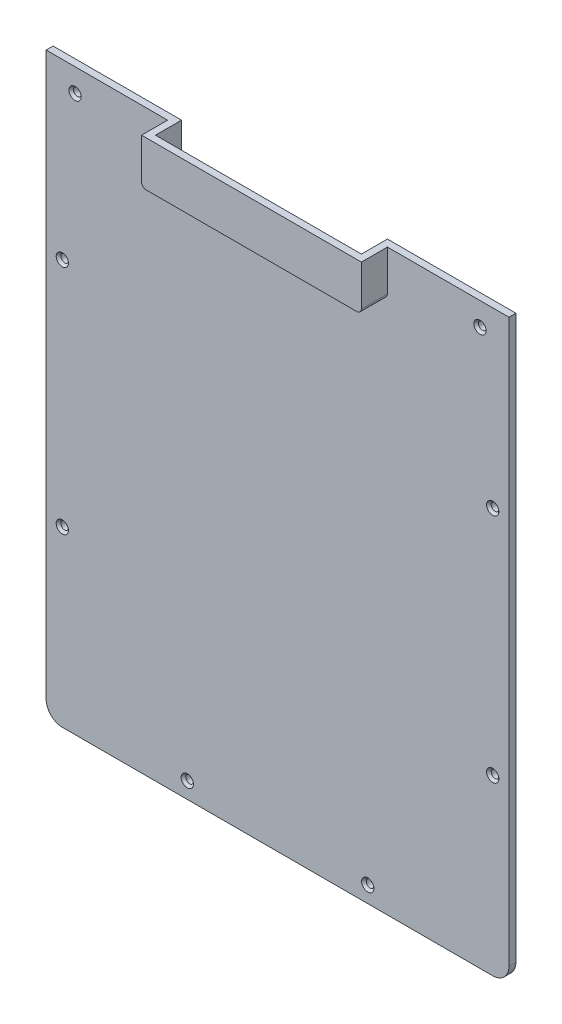
ISO-10303-21;
HEADER;
FILE_DESCRIPTION(('STEP AP214'),'2;1');
FILE_NAME('part.step','',(''),(''),'','','');
FILE_SCHEMA(('AUTOMOTIVE_DESIGN { 1 0 10303 214 1 1 1 1 }'));
ENDSEC;
DATA;
#1=APPLICATION_CONTEXT('core data for automotive mechanical design processes');
#2=APPLICATION_PROTOCOL_DEFINITION('international standard','automotive_design',2000,#1);
#3=PRODUCT_CONTEXT('',#1,'mechanical');
#4=PRODUCT('Part','Part','',(#3));
#5=PRODUCT_RELATED_PRODUCT_CATEGORY('part','',(#4));
#6=PRODUCT_DEFINITION_FORMATION('','',#4);
#7=PRODUCT_DEFINITION_CONTEXT('part definition',#1,'design');
#8=PRODUCT_DEFINITION('design','',#6,#7);
#9=PRODUCT_DEFINITION_SHAPE('','',#8);
#10=(LENGTH_UNIT() NAMED_UNIT(*) SI_UNIT(.MILLI.,.METRE.));
#11=(NAMED_UNIT(*) PLANE_ANGLE_UNIT() SI_UNIT($,.RADIAN.));
#12=(NAMED_UNIT(*) SI_UNIT($,.STERADIAN.) SOLID_ANGLE_UNIT());
#13=UNCERTAINTY_MEASURE_WITH_UNIT(LENGTH_MEASURE(1.E-05),#10,'distance_accuracy_value','');
#14=(GEOMETRIC_REPRESENTATION_CONTEXT(3) GLOBAL_UNCERTAINTY_ASSIGNED_CONTEXT((#13)) GLOBAL_UNIT_ASSIGNED_CONTEXT((#10,
#11,#12)) REPRESENTATION_CONTEXT('',''));
#15=CARTESIAN_POINT('',(0.,0.,0.));
#16=DIRECTION('',(0.,0.,1.));
#17=DIRECTION('',(1.,0.,0.));
#18=AXIS2_PLACEMENT_3D('',#15,#16,#17);
#19=CARTESIAN_POINT('',(0.,250.,3.));
#20=DIRECTION('',(0.,-1.,0.));
#21=DIRECTION('',(0.,0.,-1.));
#22=AXIS2_PLACEMENT_3D('',#19,#20,#21);
#23=PLANE('',#22);
#24=DIRECTION('',(0.,0.,-1.));
#25=VECTOR('',#24,1.);
#26=CARTESIAN_POINT('',(55.5,250.,93.5165730681404));
#27=LINE('',#26,#25);
#28=CARTESIAN_POINT('',(55.5,250.,11.2500000000001));
#29=VERTEX_POINT('',#28);
#30=CARTESIAN_POINT('',(55.5,250.,0.));
#31=VERTEX_POINT('',#30);
#32=EDGE_CURVE('E215',#29,#31,#27,.T.);
#33=ORIENTED_EDGE('',*,*,#32,.T.);
#34=DIRECTION('',(-1.,0.,0.));
#35=VECTOR('',#34,1.);
#36=CARTESIAN_POINT('',(0.,250.,0.));
#37=LINE('',#36,#35);
#38=CARTESIAN_POINT('',(0.,250.,0.));
#39=VERTEX_POINT('',#38);
#40=EDGE_CURVE('E241',#31,#39,#37,.T.);
#41=ORIENTED_EDGE('',*,*,#40,.T.);
#42=DIRECTION('',(0.,0.,-1.));
#43=VECTOR('',#42,1.);
#44=CARTESIAN_POINT('',(0.,250.,3.));
#45=LINE('',#44,#43);
#46=CARTESIAN_POINT('',(0.,250.,3.));
#47=VERTEX_POINT('',#46);
#48=EDGE_CURVE('E233',#47,#39,#45,.T.);
#49=ORIENTED_EDGE('',*,*,#48,.F.);
#50=DIRECTION('',(-1.,0.,0.));
#51=VECTOR('',#50,1.);
#52=CARTESIAN_POINT('',(0.,250.,3.));
#53=LINE('',#52,#51);
#54=CARTESIAN_POINT('',(52.5,250.,3.));
#55=VERTEX_POINT('',#54);
#56=EDGE_CURVE('E230',#55,#47,#53,.T.);
#57=ORIENTED_EDGE('',*,*,#56,.F.);
#58=DIRECTION('',(0.,0.,-1.));
#59=VECTOR('',#58,1.);
#60=CARTESIAN_POINT('',(52.5,250.,11.2500000000001));
#61=LINE('',#60,#59);
#62=CARTESIAN_POINT('',(52.5,250.,14.2500000000001));
#63=VERTEX_POINT('',#62);
#64=EDGE_CURVE('E180',#63,#55,#61,.T.);
#65=ORIENTED_EDGE('',*,*,#64,.F.);
#66=DIRECTION('',(-1.,0.,0.));
#67=VECTOR('',#66,1.);
#68=CARTESIAN_POINT('',(52.5,250.,14.2500000000001));
#69=LINE('',#68,#67);
#70=CARTESIAN_POINT('',(147.5,250.,14.2500000000001));
#71=VERTEX_POINT('',#70);
#72=EDGE_CURVE('E164',#71,#63,#69,.T.);
#73=ORIENTED_EDGE('',*,*,#72,.F.);
#74=DIRECTION('',(0.,0.,-1.));
#75=VECTOR('',#74,1.);
#76=CARTESIAN_POINT('',(147.5,250.,11.2500000000001));
#77=LINE('',#76,#75);
#78=CARTESIAN_POINT('',(147.5,250.,3.));
#79=VERTEX_POINT('',#78);
#80=EDGE_CURVE('E173',#71,#79,#77,.T.);
#81=ORIENTED_EDGE('',*,*,#80,.T.);
#82=CARTESIAN_POINT('',(200.,250.,3.));
#83=VERTEX_POINT('',#82);
#84=EDGE_CURVE('E231',#83,#79,#53,.T.);
#85=ORIENTED_EDGE('',*,*,#84,.F.);
#86=DIRECTION('',(0.,0.,-1.));
#87=VECTOR('',#86,1.);
#88=CARTESIAN_POINT('',(200.,250.,3.));
#89=LINE('',#88,#87);
#90=CARTESIAN_POINT('',(200.,250.,0.));
#91=VERTEX_POINT('',#90);
#92=EDGE_CURVE('E246',#83,#91,#89,.T.);
#93=ORIENTED_EDGE('',*,*,#92,.T.);
#94=CARTESIAN_POINT('',(144.5,250.,0.));
#95=VERTEX_POINT('',#94);
#96=EDGE_CURVE('E225',#91,#95,#37,.T.);
#97=ORIENTED_EDGE('',*,*,#96,.T.);
#98=DIRECTION('',(0.,0.,-1.));
#99=VECTOR('',#98,1.);
#100=CARTESIAN_POINT('',(144.5,250.,93.5165730681404));
#101=LINE('',#100,#99);
#102=CARTESIAN_POINT('',(144.5,250.,11.2500000000001));
#103=VERTEX_POINT('',#102);
#104=EDGE_CURVE('E217',#103,#95,#101,.T.);
#105=ORIENTED_EDGE('',*,*,#104,.F.);
#106=DIRECTION('',(-1.,0.,0.));
#107=VECTOR('',#106,1.);
#108=CARTESIAN_POINT('',(52.5,250.,11.2500000000001));
#109=LINE('',#108,#107);
#110=EDGE_CURVE('E192',#103,#29,#109,.T.);
#111=ORIENTED_EDGE('',*,*,#110,.T.);
#112=EDGE_LOOP('',(#33,#41,#49,#57,#65,#73,#81,#85,#93,#97,#105,#111));
#113=FACE_BOUND('',#112,.T.);
#114=ADVANCED_FACE('F33',(#113),#23,.F.);
#115=CARTESIAN_POINT('',(0.,0.,3.));
#116=DIRECTION('',(0.,0.,-1.));
#117=DIRECTION('',(-1.,0.,0.));
#118=AXIS2_PLACEMENT_3D('',#115,#116,#117);
#119=PLANE('',#118);
#120=CARTESIAN_POINT('',(61.,7.00000000000001,3.));
#121=DIRECTION('',(0.,0.,-1.));
#122=DIRECTION('',(-1.,0.,0.));
#123=AXIS2_PLACEMENT_3D('',#120,#121,#122);
#124=CIRCLE('',#123,2.65000000000008);
#125=CARTESIAN_POINT('',(58.3499999999999,7.00000000000001,3.));
#126=VERTEX_POINT('',#125);
#127=EDGE_CURVE('E323',#126,#126,#124,.T.);
#128=ORIENTED_EDGE('',*,*,#127,.T.);
#129=EDGE_LOOP('',(#128));
#130=FACE_BOUND('',#129,.T.);
#131=CARTESIAN_POINT('',(139.,7.00000000000003,3.));
#132=DIRECTION('',(0.,0.,-1.));
#133=DIRECTION('',(-1.,0.,0.));
#134=AXIS2_PLACEMENT_3D('',#131,#132,#133);
#135=CIRCLE('',#134,2.65000000000007);
#136=CARTESIAN_POINT('',(136.35,7.00000000000003,3.));
#137=VERTEX_POINT('',#136);
#138=EDGE_CURVE('E320',#137,#137,#135,.T.);
#139=ORIENTED_EDGE('',*,*,#138,.T.);
#140=EDGE_LOOP('',(#139));
#141=FACE_BOUND('',#140,.T.);
#142=CARTESIAN_POINT('',(193.,75.,3.));
#143=DIRECTION('',(0.,0.,-1.));
#144=DIRECTION('',(-1.,0.,0.));
#145=AXIS2_PLACEMENT_3D('',#142,#143,#144);
#146=CIRCLE('',#145,2.64999999999999);
#147=CARTESIAN_POINT('',(190.35,75.,3.));
#148=VERTEX_POINT('',#147);
#149=EDGE_CURVE('E317',#148,#148,#146,.T.);
#150=ORIENTED_EDGE('',*,*,#149,.T.);
#151=EDGE_LOOP('',(#150));
#152=FACE_BOUND('',#151,.T.);
#153=CARTESIAN_POINT('',(7.,75.,3.));
#154=DIRECTION('',(0.,0.,-1.));
#155=DIRECTION('',(-1.,0.,0.));
#156=AXIS2_PLACEMENT_3D('',#153,#154,#155);
#157=CIRCLE('',#156,2.64999999999999);
#158=CARTESIAN_POINT('',(4.35000000000001,75.,3.));
#159=VERTEX_POINT('',#158);
#160=EDGE_CURVE('E314',#159,#159,#157,.T.);
#161=ORIENTED_EDGE('',*,*,#160,.T.);
#162=EDGE_LOOP('',(#161));
#163=FACE_BOUND('',#162,.T.);
#164=CARTESIAN_POINT('',(7.,175.,3.));
#165=DIRECTION('',(0.,0.,-1.));
#166=DIRECTION('',(-1.,0.,0.));
#167=AXIS2_PLACEMENT_3D('',#164,#165,#166);
#168=CIRCLE('',#167,2.65000000000007);
#169=CARTESIAN_POINT('',(4.34999999999993,175.,3.));
#170=VERTEX_POINT('',#169);
#171=EDGE_CURVE('E311',#170,#170,#168,.T.);
#172=ORIENTED_EDGE('',*,*,#171,.T.);
#173=EDGE_LOOP('',(#172));
#174=FACE_BOUND('',#173,.T.);
#175=CARTESIAN_POINT('',(12.4999999999999,240.,3.));
#176=DIRECTION('',(0.,0.,-1.));
#177=DIRECTION('',(-1.,0.,0.));
#178=AXIS2_PLACEMENT_3D('',#175,#176,#177);
#179=CIRCLE('',#178,2.65000000000007);
#180=CARTESIAN_POINT('',(9.84999999999983,240.,3.));
#181=VERTEX_POINT('',#180);
#182=EDGE_CURVE('E308',#181,#181,#179,.T.);
#183=ORIENTED_EDGE('',*,*,#182,.T.);
#184=EDGE_LOOP('',(#183));
#185=FACE_BOUND('',#184,.T.);
#186=CARTESIAN_POINT('',(187.5,240.,3.));
#187=DIRECTION('',(0.,0.,-1.));
#188=DIRECTION('',(-1.,0.,0.));
#189=AXIS2_PLACEMENT_3D('',#186,#187,#188);
#190=CIRCLE('',#189,2.65000000000007);
#191=CARTESIAN_POINT('',(184.85,240.,3.));
#192=VERTEX_POINT('',#191);
#193=EDGE_CURVE('E305',#192,#192,#190,.T.);
#194=ORIENTED_EDGE('',*,*,#193,.T.);
#195=EDGE_LOOP('',(#194));
#196=FACE_BOUND('',#195,.T.);
#197=CARTESIAN_POINT('',(193.,175.,3.));
#198=DIRECTION('',(0.,0.,-1.));
#199=DIRECTION('',(-1.,0.,0.));
#200=AXIS2_PLACEMENT_3D('',#197,#198,#199);
#201=CIRCLE('',#200,2.65000000000007);
#202=CARTESIAN_POINT('',(190.35,175.,3.));
#203=VERTEX_POINT('',#202);
#204=EDGE_CURVE('E302',#203,#203,#201,.T.);
#205=ORIENTED_EDGE('',*,*,#204,.T.);
#206=EDGE_LOOP('',(#205));
#207=FACE_BOUND('',#206,.T.);
#208=ORIENTED_EDGE('',*,*,#84,.T.);
#209=DIRECTION('',(0.,1.,0.));
#210=VECTOR('',#209,1.);
#211=CARTESIAN_POINT('',(147.5,250.,3.));
#212=LINE('',#211,#210);
#213=CARTESIAN_POINT('',(147.5,232.5,3.));
#214=VERTEX_POINT('',#213);
#215=EDGE_CURVE('E176',#79,#214,#212,.F.);
#216=ORIENTED_EDGE('',*,*,#215,.T.);
#217=CARTESIAN_POINT('',(145.5,232.5,3.));
#218=DIRECTION('',(0.,0.,-1.));
#219=DIRECTION('',(-1.,0.,0.));
#220=AXIS2_PLACEMENT_3D('',#217,#218,#219);
#221=CIRCLE('',#220,2.);
#222=CARTESIAN_POINT('',(145.5,230.5,3.));
#223=VERTEX_POINT('',#222);
#224=EDGE_CURVE('E296',#214,#223,#221,.T.);
#225=ORIENTED_EDGE('',*,*,#224,.T.);
#226=DIRECTION('',(1.,0.,0.));
#227=VECTOR('',#226,1.);
#228=CARTESIAN_POINT('',(144.5,230.5,3.));
#229=LINE('',#228,#227);
#230=CARTESIAN_POINT('',(54.5,230.5,3.));
#231=VERTEX_POINT('',#230);
#232=EDGE_CURVE('E188',#223,#231,#229,.F.);
#233=ORIENTED_EDGE('',*,*,#232,.T.);
#234=CARTESIAN_POINT('',(54.5,232.5,3.));
#235=DIRECTION('',(0.,0.,-1.));
#236=DIRECTION('',(-1.,0.,0.));
#237=AXIS2_PLACEMENT_3D('',#234,#235,#236);
#238=CIRCLE('',#237,2.);
#239=CARTESIAN_POINT('',(52.5,232.5,3.));
#240=VERTEX_POINT('',#239);
#241=EDGE_CURVE('E48',#231,#240,#238,.T.);
#242=ORIENTED_EDGE('',*,*,#241,.T.);
#243=DIRECTION('',(0.,1.,0.));
#244=VECTOR('',#243,1.);
#245=CARTESIAN_POINT('',(52.5,233.5,3.));
#246=LINE('',#245,#244);
#247=EDGE_CURVE('E186',#240,#55,#246,.T.);
#248=ORIENTED_EDGE('',*,*,#247,.T.);
#249=ORIENTED_EDGE('',*,*,#56,.T.);
#250=DIRECTION('',(0.,-1.,0.));
#251=VECTOR('',#250,1.);
#252=CARTESIAN_POINT('',(0.,0.,3.));
#253=LINE('',#252,#251);
#254=CARTESIAN_POINT('',(0.,7.,3.));
#255=VERTEX_POINT('',#254);
#256=EDGE_CURVE('E221',#47,#255,#253,.T.);
#257=ORIENTED_EDGE('',*,*,#256,.T.);
#258=CARTESIAN_POINT('',(7.,7.,3.));
#259=DIRECTION('',(0.,0.,-1.));
#260=DIRECTION('',(-1.,0.,0.));
#261=AXIS2_PLACEMENT_3D('',#258,#259,#260);
#262=CIRCLE('',#261,7.);
#263=CARTESIAN_POINT('',(7.,0.,3.));
#264=VERTEX_POINT('',#263);
#265=EDGE_CURVE('E262',#255,#264,#262,.F.);
#266=ORIENTED_EDGE('',*,*,#265,.T.);
#267=DIRECTION('',(1.,0.,0.));
#268=VECTOR('',#267,1.);
#269=CARTESIAN_POINT('',(0.,0.,3.));
#270=LINE('',#269,#268);
#271=CARTESIAN_POINT('',(193.,0.,3.));
#272=VERTEX_POINT('',#271);
#273=EDGE_CURVE('E224',#264,#272,#270,.T.);
#274=ORIENTED_EDGE('',*,*,#273,.T.);
#275=CARTESIAN_POINT('',(193.,7.,3.));
#276=DIRECTION('',(0.,0.,-1.));
#277=DIRECTION('',(-1.,0.,0.));
#278=AXIS2_PLACEMENT_3D('',#275,#276,#277);
#279=CIRCLE('',#278,7.);
#280=CARTESIAN_POINT('',(200.,7.,3.));
#281=VERTEX_POINT('',#280);
#282=EDGE_CURVE('E260',#272,#281,#279,.F.);
#283=ORIENTED_EDGE('',*,*,#282,.T.);
#284=DIRECTION('',(0.,1.,0.));
#285=VECTOR('',#284,1.);
#286=CARTESIAN_POINT('',(200.,0.,3.));
#287=LINE('',#286,#285);
#288=EDGE_CURVE('E228',#281,#83,#287,.T.);
#289=ORIENTED_EDGE('',*,*,#288,.T.);
#290=EDGE_LOOP('',(#208,#216,#225,#233,#242,#248,#249,#257,#266,#274,#283,#289));
#291=FACE_BOUND('',#290,.T.);
#292=ADVANCED_FACE('F360',(#130,#141,#152,#163,#174,#185,#196,#207,#291),#119,.F.);
#293=CARTESIAN_POINT('',(0.,0.,0.));
#294=DIRECTION('',(0.,0.,-1.));
#295=DIRECTION('',(-1.,0.,0.));
#296=AXIS2_PLACEMENT_3D('',#293,#294,#295);
#297=PLANE('',#296);
#298=CARTESIAN_POINT('',(187.5,240.,0.));
#299=DIRECTION('',(0.,0.,1.));
#300=DIRECTION('',(1.,0.,0.));
#301=AXIS2_PLACEMENT_3D('',#298,#299,#300);
#302=CIRCLE('',#301,1.65000000000002);
#303=CARTESIAN_POINT('',(189.15,240.,0.));
#304=VERTEX_POINT('',#303);
#305=EDGE_CURVE('E443',#304,#304,#302,.T.);
#306=ORIENTED_EDGE('',*,*,#305,.T.);
#307=EDGE_LOOP('',(#306));
#308=FACE_BOUND('',#307,.T.);
#309=CARTESIAN_POINT('',(7.,175.,0.));
#310=DIRECTION('',(0.,0.,1.));
#311=DIRECTION('',(1.,0.,0.));
#312=AXIS2_PLACEMENT_3D('',#309,#310,#311);
#313=CIRCLE('',#312,1.65000000000001);
#314=CARTESIAN_POINT('',(8.65000000000001,175.,0.));
#315=VERTEX_POINT('',#314);
#316=EDGE_CURVE('E441',#315,#315,#313,.T.);
#317=ORIENTED_EDGE('',*,*,#316,.T.);
#318=EDGE_LOOP('',(#317));
#319=FACE_BOUND('',#318,.T.);
#320=CARTESIAN_POINT('',(7.,75.,0.));
#321=DIRECTION('',(0.,0.,1.));
#322=DIRECTION('',(1.,0.,0.));
#323=AXIS2_PLACEMENT_3D('',#320,#321,#322);
#324=CIRCLE('',#323,1.65);
#325=CARTESIAN_POINT('',(8.65,75.,0.));
#326=VERTEX_POINT('',#325);
#327=EDGE_CURVE('E444',#326,#326,#324,.T.);
#328=ORIENTED_EDGE('',*,*,#327,.T.);
#329=EDGE_LOOP('',(#328));
#330=FACE_BOUND('',#329,.T.);
#331=CARTESIAN_POINT('',(61.,7.00000000000001,0.));
#332=DIRECTION('',(0.,0.,1.));
#333=DIRECTION('',(1.,0.,0.));
#334=AXIS2_PLACEMENT_3D('',#331,#332,#333);
#335=CIRCLE('',#334,1.65000000000001);
#336=CARTESIAN_POINT('',(62.65,7.00000000000001,0.));
#337=VERTEX_POINT('',#336);
#338=EDGE_CURVE('E449',#337,#337,#335,.T.);
#339=ORIENTED_EDGE('',*,*,#338,.T.);
#340=EDGE_LOOP('',(#339));
#341=FACE_BOUND('',#340,.T.);
#342=CARTESIAN_POINT('',(193.,75.,0.));
#343=DIRECTION('',(0.,0.,1.));
#344=DIRECTION('',(1.,0.,0.));
#345=AXIS2_PLACEMENT_3D('',#342,#343,#344);
#346=CIRCLE('',#345,1.65000000000002);
#347=CARTESIAN_POINT('',(194.65,75.,0.));
#348=VERTEX_POINT('',#347);
#349=EDGE_CURVE('E715',#348,#348,#346,.T.);
#350=ORIENTED_EDGE('',*,*,#349,.T.);
#351=EDGE_LOOP('',(#350));
#352=FACE_BOUND('',#351,.T.);
#353=CARTESIAN_POINT('',(193.,175.,0.));
#354=DIRECTION('',(0.,0.,1.));
#355=DIRECTION('',(1.,0.,0.));
#356=AXIS2_PLACEMENT_3D('',#353,#354,#355);
#357=CIRCLE('',#356,1.65000000000002);
#358=CARTESIAN_POINT('',(194.65,175.,0.));
#359=VERTEX_POINT('',#358);
#360=EDGE_CURVE('E719',#359,#359,#357,.T.);
#361=ORIENTED_EDGE('',*,*,#360,.T.);
#362=EDGE_LOOP('',(#361));
#363=FACE_BOUND('',#362,.T.);
#364=CARTESIAN_POINT('',(139.,7.00000000000003,0.));
#365=DIRECTION('',(0.,0.,1.));
#366=DIRECTION('',(1.,0.,0.));
#367=AXIS2_PLACEMENT_3D('',#364,#365,#366);
#368=CIRCLE('',#367,1.65000000000002);
#369=CARTESIAN_POINT('',(140.65,7.00000000000003,0.));
#370=VERTEX_POINT('',#369);
#371=EDGE_CURVE('E455',#370,#370,#368,.T.);
#372=ORIENTED_EDGE('',*,*,#371,.T.);
#373=EDGE_LOOP('',(#372));
#374=FACE_BOUND('',#373,.T.);
#375=CARTESIAN_POINT('',(12.4999999999999,240.,0.));
#376=DIRECTION('',(0.,0.,1.));
#377=DIRECTION('',(1.,0.,0.));
#378=AXIS2_PLACEMENT_3D('',#375,#376,#377);
#379=CIRCLE('',#378,1.65000000000001);
#380=CARTESIAN_POINT('',(14.1499999999999,240.,0.));
#381=VERTEX_POINT('',#380);
#382=EDGE_CURVE('E196',#381,#381,#379,.T.);
#383=ORIENTED_EDGE('',*,*,#382,.T.);
#384=EDGE_LOOP('',(#383));
#385=FACE_BOUND('',#384,.T.);
#386=DIRECTION('',(0.,-1.,0.));
#387=VECTOR('',#386,1.);
#388=CARTESIAN_POINT('',(55.5,233.5,0.));
#389=LINE('',#388,#387);
#390=CARTESIAN_POINT('',(55.5,235.5,0.));
#391=VERTEX_POINT('',#390);
#392=EDGE_CURVE('E207',#31,#391,#389,.T.);
#393=ORIENTED_EDGE('',*,*,#392,.T.);
#394=CARTESIAN_POINT('',(57.5,235.5,0.));
#395=DIRECTION('',(0.,0.,-1.));
#396=DIRECTION('',(-1.,0.,0.));
#397=AXIS2_PLACEMENT_3D('',#394,#395,#396);
#398=CIRCLE('',#397,2.);
#399=CARTESIAN_POINT('',(57.5,233.5,0.));
#400=VERTEX_POINT('',#399);
#401=EDGE_CURVE('E281',#391,#400,#398,.F.);
#402=ORIENTED_EDGE('',*,*,#401,.T.);
#403=DIRECTION('',(1.,0.,0.));
#404=VECTOR('',#403,1.);
#405=CARTESIAN_POINT('',(144.5,233.5,0.));
#406=LINE('',#405,#404);
#407=CARTESIAN_POINT('',(142.5,233.5,0.));
#408=VERTEX_POINT('',#407);
#409=EDGE_CURVE('E210',#400,#408,#406,.T.);
#410=ORIENTED_EDGE('',*,*,#409,.T.);
#411=CARTESIAN_POINT('',(142.5,235.5,0.));
#412=DIRECTION('',(0.,0.,-1.));
#413=DIRECTION('',(-1.,0.,0.));
#414=AXIS2_PLACEMENT_3D('',#411,#412,#413);
#415=CIRCLE('',#414,2.);
#416=CARTESIAN_POINT('',(144.5,235.5,0.));
#417=VERTEX_POINT('',#416);
#418=EDGE_CURVE('E283',#408,#417,#415,.F.);
#419=ORIENTED_EDGE('',*,*,#418,.T.);
#420=DIRECTION('',(0.,1.,0.));
#421=VECTOR('',#420,1.);
#422=CARTESIAN_POINT('',(144.5,233.5,0.));
#423=LINE('',#422,#421);
#424=EDGE_CURVE('E213',#417,#95,#423,.T.);
#425=ORIENTED_EDGE('',*,*,#424,.T.);
#426=ORIENTED_EDGE('',*,*,#96,.F.);
#427=DIRECTION('',(0.,1.,0.));
#428=VECTOR('',#427,1.);
#429=CARTESIAN_POINT('',(200.,0.,0.));
#430=LINE('',#429,#428);
#431=CARTESIAN_POINT('',(200.,7.,0.));
#432=VERTEX_POINT('',#431);
#433=EDGE_CURVE('E239',#432,#91,#430,.T.);
#434=ORIENTED_EDGE('',*,*,#433,.F.);
#435=CARTESIAN_POINT('',(193.,7.,0.));
#436=DIRECTION('',(0.,0.,-1.));
#437=DIRECTION('',(-1.,0.,0.));
#438=AXIS2_PLACEMENT_3D('',#435,#436,#437);
#439=CIRCLE('',#438,7.);
#440=CARTESIAN_POINT('',(193.,0.,0.));
#441=VERTEX_POINT('',#440);
#442=EDGE_CURVE('E254',#432,#441,#439,.T.);
#443=ORIENTED_EDGE('',*,*,#442,.T.);
#444=DIRECTION('',(1.,0.,0.));
#445=VECTOR('',#444,1.);
#446=CARTESIAN_POINT('',(0.,0.,0.));
#447=LINE('',#446,#445);
#448=CARTESIAN_POINT('',(7.,0.,0.));
#449=VERTEX_POINT('',#448);
#450=EDGE_CURVE('E236',#449,#441,#447,.T.);
#451=ORIENTED_EDGE('',*,*,#450,.F.);
#452=CARTESIAN_POINT('',(7.,7.,0.));
#453=DIRECTION('',(0.,0.,-1.));
#454=DIRECTION('',(-1.,0.,0.));
#455=AXIS2_PLACEMENT_3D('',#452,#453,#454);
#456=CIRCLE('',#455,7.);
#457=CARTESIAN_POINT('',(0.,7.,0.));
#458=VERTEX_POINT('',#457);
#459=EDGE_CURVE('E256',#449,#458,#456,.T.);
#460=ORIENTED_EDGE('',*,*,#459,.T.);
#461=DIRECTION('',(0.,-1.,0.));
#462=VECTOR('',#461,1.);
#463=CARTESIAN_POINT('',(0.,0.,0.));
#464=LINE('',#463,#462);
#465=EDGE_CURVE('E220',#39,#458,#464,.T.);
#466=ORIENTED_EDGE('',*,*,#465,.F.);
#467=ORIENTED_EDGE('',*,*,#40,.F.);
#468=EDGE_LOOP('',(#393,#402,#410,#419,#425,#426,#434,#443,#451,#460,#466,#467));
#469=FACE_BOUND('',#468,.T.);
#470=ADVANCED_FACE('F367',(#308,#319,#330,#341,#352,#363,#374,#385,#469),#297,.T.);
#471=CARTESIAN_POINT('',(0.,0.,3.));
#472=DIRECTION('',(1.,0.,0.));
#473=DIRECTION('',(0.,0.,-1.));
#474=AXIS2_PLACEMENT_3D('',#471,#472,#473);
#475=PLANE('',#474);
#476=ORIENTED_EDGE('',*,*,#465,.T.);
#477=DIRECTION('',(0.,0.,-1.));
#478=VECTOR('',#477,1.);
#479=CARTESIAN_POINT('',(0.,7.,3.));
#480=LINE('',#479,#478);
#481=EDGE_CURVE('E258',#458,#255,#480,.F.);
#482=ORIENTED_EDGE('',*,*,#481,.T.);
#483=ORIENTED_EDGE('',*,*,#256,.F.);
#484=ORIENTED_EDGE('',*,*,#48,.T.);
#485=EDGE_LOOP('',(#476,#482,#483,#484));
#486=FACE_BOUND('',#485,.T.);
#487=ADVANCED_FACE('F380',(#486),#475,.F.);
#488=CARTESIAN_POINT('',(0.,0.,3.));
#489=DIRECTION('',(0.,1.,0.));
#490=DIRECTION('',(0.,0.,1.));
#491=AXIS2_PLACEMENT_3D('',#488,#489,#490);
#492=PLANE('',#491);
#493=ORIENTED_EDGE('',*,*,#273,.F.);
#494=DIRECTION('',(0.,0.,-1.));
#495=VECTOR('',#494,1.);
#496=CARTESIAN_POINT('',(7.,0.,3.));
#497=LINE('',#496,#495);
#498=EDGE_CURVE('E251',#264,#449,#497,.T.);
#499=ORIENTED_EDGE('',*,*,#498,.T.);
#500=ORIENTED_EDGE('',*,*,#450,.T.);
#501=DIRECTION('',(0.,0.,-1.));
#502=VECTOR('',#501,1.);
#503=CARTESIAN_POINT('',(193.,0.,3.));
#504=LINE('',#503,#502);
#505=EDGE_CURVE('E249',#441,#272,#504,.F.);
#506=ORIENTED_EDGE('',*,*,#505,.T.);
#507=EDGE_LOOP('',(#493,#499,#500,#506));
#508=FACE_BOUND('',#507,.T.);
#509=ADVANCED_FACE('F376',(#508),#492,.F.);
#510=CARTESIAN_POINT('',(200.,0.,3.));
#511=DIRECTION('',(-1.,0.,0.));
#512=DIRECTION('',(0.,0.,1.));
#513=AXIS2_PLACEMENT_3D('',#510,#511,#512);
#514=PLANE('',#513);
#515=ORIENTED_EDGE('',*,*,#288,.F.);
#516=DIRECTION('',(0.,0.,-1.));
#517=VECTOR('',#516,1.);
#518=CARTESIAN_POINT('',(200.,7.,3.));
#519=LINE('',#518,#517);
#520=EDGE_CURVE('E264',#281,#432,#519,.T.);
#521=ORIENTED_EDGE('',*,*,#520,.T.);
#522=ORIENTED_EDGE('',*,*,#433,.T.);
#523=ORIENTED_EDGE('',*,*,#92,.F.);
#524=EDGE_LOOP('',(#515,#521,#522,#523));
#525=FACE_BOUND('',#524,.T.);
#526=ADVANCED_FACE('F372',(#525),#514,.F.);
#527=CARTESIAN_POINT('',(7.,7.,3.));
#528=DIRECTION('',(0.,0.,-1.));
#529=DIRECTION('',(-1.,0.,0.));
#530=AXIS2_PLACEMENT_3D('',#527,#528,#529);
#531=CYLINDRICAL_SURFACE('',#530,7.);
#532=ORIENTED_EDGE('',*,*,#265,.F.);
#533=ORIENTED_EDGE('',*,*,#481,.F.);
#534=ORIENTED_EDGE('',*,*,#459,.F.);
#535=ORIENTED_EDGE('',*,*,#498,.F.);
#536=EDGE_LOOP('',(#532,#533,#534,#535));
#537=FACE_BOUND('',#536,.T.);
#538=ADVANCED_FACE('F375',(#537),#531,.T.);
#539=CARTESIAN_POINT('',(193.,7.,3.));
#540=DIRECTION('',(0.,0.,-1.));
#541=DIRECTION('',(-1.,0.,0.));
#542=AXIS2_PLACEMENT_3D('',#539,#540,#541);
#543=CYLINDRICAL_SURFACE('',#542,7.);
#544=ORIENTED_EDGE('',*,*,#282,.F.);
#545=ORIENTED_EDGE('',*,*,#505,.F.);
#546=ORIENTED_EDGE('',*,*,#442,.F.);
#547=ORIENTED_EDGE('',*,*,#520,.F.);
#548=EDGE_LOOP('',(#544,#545,#546,#547));
#549=FACE_BOUND('',#548,.T.);
#550=ADVANCED_FACE('F387',(#549),#543,.T.);
#551=CARTESIAN_POINT('',(144.5,233.5,93.5165730681404));
#552=DIRECTION('',(-1.,0.,0.));
#553=DIRECTION('',(0.,0.,1.));
#554=AXIS2_PLACEMENT_3D('',#551,#552,#553);
#555=PLANE('',#554);
#556=ORIENTED_EDGE('',*,*,#424,.F.);
#557=DIRECTION('',(0.,0.,-1.));
#558=VECTOR('',#557,1.);
#559=CARTESIAN_POINT('',(144.5,235.5,11.2500000000001));
#560=LINE('',#559,#558);
#561=CARTESIAN_POINT('',(144.5,235.5,11.2500000000001));
#562=VERTEX_POINT('',#561);
#563=EDGE_CURVE('E279',#417,#562,#560,.F.);
#564=ORIENTED_EDGE('',*,*,#563,.T.);
#565=DIRECTION('',(0.,-1.,0.));
#566=VECTOR('',#565,1.);
#567=CARTESIAN_POINT('',(144.5,250.,11.2500000000001));
#568=LINE('',#567,#566);
#569=EDGE_CURVE('E199',#103,#562,#568,.T.);
#570=ORIENTED_EDGE('',*,*,#569,.F.);
#571=ORIENTED_EDGE('',*,*,#104,.T.);
#572=EDGE_LOOP('',(#556,#564,#570,#571));
#573=FACE_BOUND('',#572,.T.);
#574=ADVANCED_FACE('F391',(#573),#555,.T.);
#575=CARTESIAN_POINT('',(144.5,233.5,93.5165730681404));
#576=DIRECTION('',(0.,1.,0.));
#577=DIRECTION('',(0.,0.,1.));
#578=AXIS2_PLACEMENT_3D('',#575,#576,#577);
#579=PLANE('',#578);
#580=ORIENTED_EDGE('',*,*,#409,.F.);
#581=DIRECTION('',(0.,0.,-1.));
#582=VECTOR('',#581,1.);
#583=CARTESIAN_POINT('',(57.5,233.5,11.2500000000001));
#584=LINE('',#583,#582);
#585=CARTESIAN_POINT('',(57.5,233.5,11.2500000000001));
#586=VERTEX_POINT('',#585);
#587=EDGE_CURVE('E273',#400,#586,#584,.F.);
#588=ORIENTED_EDGE('',*,*,#587,.T.);
#589=DIRECTION('',(-1.,0.,0.));
#590=VECTOR('',#589,1.);
#591=CARTESIAN_POINT('',(144.5,233.5,11.2500000000001));
#592=LINE('',#591,#590);
#593=CARTESIAN_POINT('',(142.5,233.5,11.2500000000001));
#594=VERTEX_POINT('',#593);
#595=EDGE_CURVE('E181',#594,#586,#592,.T.);
#596=ORIENTED_EDGE('',*,*,#595,.F.);
#597=DIRECTION('',(0.,0.,-1.));
#598=VECTOR('',#597,1.);
#599=CARTESIAN_POINT('',(142.5,233.5,0.));
#600=LINE('',#599,#598);
#601=EDGE_CURVE('E270',#594,#408,#600,.T.);
#602=ORIENTED_EDGE('',*,*,#601,.T.);
#603=EDGE_LOOP('',(#580,#588,#596,#602));
#604=FACE_BOUND('',#603,.T.);
#605=ADVANCED_FACE('F510',(#604),#579,.T.);
#606=CARTESIAN_POINT('',(55.5,233.5,93.5165730681404));
#607=DIRECTION('',(1.,0.,0.));
#608=DIRECTION('',(0.,0.,-1.));
#609=AXIS2_PLACEMENT_3D('',#606,#607,#608);
#610=PLANE('',#609);
#611=DIRECTION('',(0.,1.,0.));
#612=VECTOR('',#611,1.);
#613=CARTESIAN_POINT('',(55.5,233.5,11.2500000000001));
#614=LINE('',#613,#612);
#615=CARTESIAN_POINT('',(55.5,235.5,11.2500000000001));
#616=VERTEX_POINT('',#615);
#617=EDGE_CURVE('E197',#616,#29,#614,.T.);
#618=ORIENTED_EDGE('',*,*,#617,.F.);
#619=DIRECTION('',(0.,0.,-1.));
#620=VECTOR('',#619,1.);
#621=CARTESIAN_POINT('',(55.5,235.5,0.));
#622=LINE('',#621,#620);
#623=EDGE_CURVE('E267',#616,#391,#622,.T.);
#624=ORIENTED_EDGE('',*,*,#623,.T.);
#625=ORIENTED_EDGE('',*,*,#392,.F.);
#626=ORIENTED_EDGE('',*,*,#32,.F.);
#627=EDGE_LOOP('',(#618,#624,#625,#626));
#628=FACE_BOUND('',#627,.T.);
#629=ADVANCED_FACE('F483',(#628),#610,.T.);
#630=CARTESIAN_POINT('',(52.5,233.5,11.2500000000001));
#631=DIRECTION('',(-1.,0.,0.));
#632=DIRECTION('',(0.,0.,1.));
#633=AXIS2_PLACEMENT_3D('',#630,#631,#632);
#634=PLANE('',#633);
#635=ORIENTED_EDGE('',*,*,#247,.F.);
#636=DIRECTION('',(0.,0.,-1.));
#637=VECTOR('',#636,1.);
#638=CARTESIAN_POINT('',(52.5,232.5,11.2500000000001));
#639=LINE('',#638,#637);
#640=CARTESIAN_POINT('',(52.5,232.5,14.2500000000001));
#641=VERTEX_POINT('',#640);
#642=EDGE_CURVE('E55',#240,#641,#639,.F.);
#643=ORIENTED_EDGE('',*,*,#642,.T.);
#644=DIRECTION('',(0.,-1.,0.));
#645=VECTOR('',#644,1.);
#646=CARTESIAN_POINT('',(52.5,250.,14.2500000000001));
#647=LINE('',#646,#645);
#648=EDGE_CURVE('E195',#63,#641,#647,.T.);
#649=ORIENTED_EDGE('',*,*,#648,.F.);
#650=ORIENTED_EDGE('',*,*,#64,.T.);
#651=EDGE_LOOP('',(#635,#643,#649,#650));
#652=FACE_BOUND('',#651,.T.);
#653=ADVANCED_FACE('F496',(#652),#634,.T.);
#654=CARTESIAN_POINT('',(144.5,230.5,11.2500000000001));
#655=DIRECTION('',(0.,-1.,0.));
#656=DIRECTION('',(0.,0.,-1.));
#657=AXIS2_PLACEMENT_3D('',#654,#655,#656);
#658=PLANE('',#657);
#659=ORIENTED_EDGE('',*,*,#232,.F.);
#660=DIRECTION('',(0.,0.,-1.));
#661=VECTOR('',#660,1.);
#662=CARTESIAN_POINT('',(145.5,230.5,11.2500000000001));
#663=LINE('',#662,#661);
#664=CARTESIAN_POINT('',(145.5,230.5,14.2500000000001));
#665=VERTEX_POINT('',#664);
#666=EDGE_CURVE('E290',#223,#665,#663,.F.);
#667=ORIENTED_EDGE('',*,*,#666,.T.);
#668=DIRECTION('',(1.,0.,0.));
#669=VECTOR('',#668,1.);
#670=CARTESIAN_POINT('',(52.5,230.5,14.2500000000001));
#671=LINE('',#670,#669);
#672=CARTESIAN_POINT('',(54.5,230.5,14.2500000000001));
#673=VERTEX_POINT('',#672);
#674=EDGE_CURVE('E170',#673,#665,#671,.T.);
#675=ORIENTED_EDGE('',*,*,#674,.F.);
#676=DIRECTION('',(0.,0.,-1.));
#677=VECTOR('',#676,1.);
#678=CARTESIAN_POINT('',(54.5,230.5,11.2500000000001));
#679=LINE('',#678,#677);
#680=EDGE_CURVE('E287',#673,#231,#679,.T.);
#681=ORIENTED_EDGE('',*,*,#680,.T.);
#682=EDGE_LOOP('',(#659,#667,#675,#681));
#683=FACE_BOUND('',#682,.T.);
#684=ADVANCED_FACE('F497',(#683),#658,.T.);
#685=CARTESIAN_POINT('',(147.5,250.,11.2500000000001));
#686=DIRECTION('',(1.,0.,0.));
#687=DIRECTION('',(0.,0.,-1.));
#688=AXIS2_PLACEMENT_3D('',#685,#686,#687);
#689=PLANE('',#688);
#690=DIRECTION('',(0.,1.,0.));
#691=VECTOR('',#690,1.);
#692=CARTESIAN_POINT('',(147.5,250.,14.2500000000001));
#693=LINE('',#692,#691);
#694=CARTESIAN_POINT('',(147.5,232.5,14.2500000000001));
#695=VERTEX_POINT('',#694);
#696=EDGE_CURVE('E159',#695,#71,#693,.T.);
#697=ORIENTED_EDGE('',*,*,#696,.F.);
#698=DIRECTION('',(0.,0.,-1.));
#699=VECTOR('',#698,1.);
#700=CARTESIAN_POINT('',(147.5,232.5,11.2500000000001));
#701=LINE('',#700,#699);
#702=EDGE_CURVE('E285',#695,#214,#701,.T.);
#703=ORIENTED_EDGE('',*,*,#702,.T.);
#704=ORIENTED_EDGE('',*,*,#215,.F.);
#705=ORIENTED_EDGE('',*,*,#80,.F.);
#706=EDGE_LOOP('',(#697,#703,#704,#705));
#707=FACE_BOUND('',#706,.T.);
#708=ADVANCED_FACE('F174',(#707),#689,.T.);
#709=CARTESIAN_POINT('',(0.,0.,11.2500000000001));
#710=DIRECTION('',(0.,0.,1.));
#711=DIRECTION('',(1.,0.,0.));
#712=AXIS2_PLACEMENT_3D('',#709,#710,#711);
#713=PLANE('',#712);
#714=ORIENTED_EDGE('',*,*,#595,.T.);
#715=CARTESIAN_POINT('',(57.5,235.5,11.2500000000001));
#716=DIRECTION('',(0.,0.,1.));
#717=DIRECTION('',(1.,0.,0.));
#718=AXIS2_PLACEMENT_3D('',#715,#716,#717);
#719=CIRCLE('',#718,2.);
#720=EDGE_CURVE('E277',#586,#616,#719,.F.);
#721=ORIENTED_EDGE('',*,*,#720,.T.);
#722=ORIENTED_EDGE('',*,*,#617,.T.);
#723=ORIENTED_EDGE('',*,*,#110,.F.);
#724=ORIENTED_EDGE('',*,*,#569,.T.);
#725=CARTESIAN_POINT('',(142.5,235.5,11.2500000000001));
#726=DIRECTION('',(0.,0.,1.));
#727=DIRECTION('',(1.,0.,0.));
#728=AXIS2_PLACEMENT_3D('',#725,#726,#727);
#729=CIRCLE('',#728,2.);
#730=EDGE_CURVE('E275',#562,#594,#729,.F.);
#731=ORIENTED_EDGE('',*,*,#730,.T.);
#732=EDGE_LOOP('',(#714,#721,#722,#723,#724,#731));
#733=FACE_BOUND('',#732,.T.);
#734=ADVANCED_FACE('F477',(#733),#713,.F.);
#735=CARTESIAN_POINT('',(0.,0.,14.2500000000001));
#736=DIRECTION('',(0.,0.,1.));
#737=DIRECTION('',(1.,0.,0.));
#738=AXIS2_PLACEMENT_3D('',#735,#736,#737);
#739=PLANE('',#738);
#740=ORIENTED_EDGE('',*,*,#674,.T.);
#741=CARTESIAN_POINT('',(145.5,232.5,14.2500000000001));
#742=DIRECTION('',(0.,0.,1.));
#743=DIRECTION('',(1.,0.,0.));
#744=AXIS2_PLACEMENT_3D('',#741,#742,#743);
#745=CIRCLE('',#744,2.);
#746=EDGE_CURVE('E166',#665,#695,#745,.T.);
#747=ORIENTED_EDGE('',*,*,#746,.T.);
#748=ORIENTED_EDGE('',*,*,#696,.T.);
#749=ORIENTED_EDGE('',*,*,#72,.T.);
#750=ORIENTED_EDGE('',*,*,#648,.T.);
#751=CARTESIAN_POINT('',(54.5,232.5,14.2500000000001));
#752=DIRECTION('',(0.,0.,1.));
#753=DIRECTION('',(1.,0.,0.));
#754=AXIS2_PLACEMENT_3D('',#751,#752,#753);
#755=CIRCLE('',#754,2.);
#756=EDGE_CURVE('E292',#641,#673,#755,.T.);
#757=ORIENTED_EDGE('',*,*,#756,.T.);
#758=EDGE_LOOP('',(#740,#747,#748,#749,#750,#757));
#759=FACE_BOUND('',#758,.T.);
#760=ADVANCED_FACE('F162',(#759),#739,.T.);
#761=CARTESIAN_POINT('',(57.5,235.5,93.5165730681404));
#762=DIRECTION('',(0.,0.,1.));
#763=DIRECTION('',(1.,0.,0.));
#764=AXIS2_PLACEMENT_3D('',#761,#762,#763);
#765=CYLINDRICAL_SURFACE('',#764,2.);
#766=ORIENTED_EDGE('',*,*,#720,.F.);
#767=ORIENTED_EDGE('',*,*,#587,.F.);
#768=ORIENTED_EDGE('',*,*,#401,.F.);
#769=ORIENTED_EDGE('',*,*,#623,.F.);
#770=EDGE_LOOP('',(#766,#767,#768,#769));
#771=FACE_BOUND('',#770,.T.);
#772=ADVANCED_FACE('F393',(#771),#765,.F.);
#773=CARTESIAN_POINT('',(142.5,235.5,93.5165730681404));
#774=DIRECTION('',(0.,0.,1.));
#775=DIRECTION('',(1.,0.,0.));
#776=AXIS2_PLACEMENT_3D('',#773,#774,#775);
#777=CYLINDRICAL_SURFACE('',#776,2.);
#778=ORIENTED_EDGE('',*,*,#730,.F.);
#779=ORIENTED_EDGE('',*,*,#563,.F.);
#780=ORIENTED_EDGE('',*,*,#418,.F.);
#781=ORIENTED_EDGE('',*,*,#601,.F.);
#782=EDGE_LOOP('',(#778,#779,#780,#781));
#783=FACE_BOUND('',#782,.T.);
#784=ADVANCED_FACE('F396',(#783),#777,.F.);
#785=CARTESIAN_POINT('',(145.5,232.5,11.2500000000001));
#786=DIRECTION('',(0.,0.,-1.));
#787=DIRECTION('',(-1.,0.,0.));
#788=AXIS2_PLACEMENT_3D('',#785,#786,#787);
#789=CYLINDRICAL_SURFACE('',#788,2.);
#790=ORIENTED_EDGE('',*,*,#746,.F.);
#791=ORIENTED_EDGE('',*,*,#666,.F.);
#792=ORIENTED_EDGE('',*,*,#224,.F.);
#793=ORIENTED_EDGE('',*,*,#702,.F.);
#794=EDGE_LOOP('',(#790,#791,#792,#793));
#795=FACE_BOUND('',#794,.T.);
#796=ADVANCED_FACE('F400',(#795),#789,.T.);
#797=CARTESIAN_POINT('',(54.5,232.5,11.2500000000001));
#798=DIRECTION('',(0.,0.,-1.));
#799=DIRECTION('',(-1.,0.,0.));
#800=AXIS2_PLACEMENT_3D('',#797,#798,#799);
#801=CYLINDRICAL_SURFACE('',#800,2.);
#802=ORIENTED_EDGE('',*,*,#756,.F.);
#803=ORIENTED_EDGE('',*,*,#642,.F.);
#804=ORIENTED_EDGE('',*,*,#241,.F.);
#805=ORIENTED_EDGE('',*,*,#680,.F.);
#806=EDGE_LOOP('',(#802,#803,#804,#805));
#807=FACE_BOUND('',#806,.T.);
#808=ADVANCED_FACE('F404',(#807),#801,.T.);
#809=CARTESIAN_POINT('',(12.4999999999999,240.,0.));
#810=DIRECTION('',(0.,0.,1.));
#811=DIRECTION('',(1.,0.,0.));
#812=AXIS2_PLACEMENT_3D('',#809,#810,#811);
#813=CYLINDRICAL_SURFACE('',#812,1.65000000000001);
#814=CARTESIAN_POINT('',(12.4999999999999,240.,1.99999999999996));
#815=DIRECTION('',(0.,0.,-1.));
#816=DIRECTION('',(-1.,0.,0.));
#817=AXIS2_PLACEMENT_3D('',#814,#815,#816);
#818=CIRCLE('',#817,1.65000000000001);
#819=CARTESIAN_POINT('',(10.8499999999999,240.,1.99999999999996));
#820=VERTEX_POINT('',#819);
#821=EDGE_CURVE('E338',#820,#820,#818,.F.);
#822=ORIENTED_EDGE('',*,*,#821,.T.);
#823=EDGE_LOOP('',(#822));
#824=FACE_BOUND('',#823,.T.);
#825=ORIENTED_EDGE('',*,*,#382,.F.);
#826=EDGE_LOOP('',(#825));
#827=FACE_BOUND('',#826,.T.);
#828=ADVANCED_FACE('F408',(#824,#827),#813,.F.);
#829=CARTESIAN_POINT('',(139.,7.00000000000003,0.));
#830=DIRECTION('',(0.,0.,1.));
#831=DIRECTION('',(1.,0.,0.));
#832=AXIS2_PLACEMENT_3D('',#829,#830,#831);
#833=CYLINDRICAL_SURFACE('',#832,1.65000000000002);
#834=CARTESIAN_POINT('',(139.,7.00000000000003,1.99999999999997));
#835=DIRECTION('',(0.,0.,-1.));
#836=DIRECTION('',(-1.,0.,0.));
#837=AXIS2_PLACEMENT_3D('',#834,#835,#836);
#838=CIRCLE('',#837,1.65000000000002);
#839=CARTESIAN_POINT('',(137.35,7.00000000000003,1.99999999999997));
#840=VERTEX_POINT('',#839);
#841=EDGE_CURVE('E326',#840,#840,#838,.F.);
#842=ORIENTED_EDGE('',*,*,#841,.T.);
#843=EDGE_LOOP('',(#842));
#844=FACE_BOUND('',#843,.T.);
#845=ORIENTED_EDGE('',*,*,#371,.F.);
#846=EDGE_LOOP('',(#845));
#847=FACE_BOUND('',#846,.T.);
#848=ADVANCED_FACE('F594',(#844,#847),#833,.F.);
#849=CARTESIAN_POINT('',(193.,175.,0.));
#850=DIRECTION('',(0.,0.,1.));
#851=DIRECTION('',(1.,0.,0.));
#852=AXIS2_PLACEMENT_3D('',#849,#850,#851);
#853=CYLINDRICAL_SURFACE('',#852,1.65000000000002);
#854=CARTESIAN_POINT('',(193.,175.,1.99999999999997));
#855=DIRECTION('',(0.,0.,-1.));
#856=DIRECTION('',(-1.,0.,0.));
#857=AXIS2_PLACEMENT_3D('',#854,#855,#856);
#858=CIRCLE('',#857,1.65000000000002);
#859=CARTESIAN_POINT('',(191.35,175.,1.99999999999997));
#860=VERTEX_POINT('',#859);
#861=EDGE_CURVE('E11',#860,#860,#858,.F.);
#862=ORIENTED_EDGE('',*,*,#861,.T.);
#863=EDGE_LOOP('',(#862));
#864=FACE_BOUND('',#863,.T.);
#865=ORIENTED_EDGE('',*,*,#360,.F.);
#866=EDGE_LOOP('',(#865));
#867=FACE_BOUND('',#866,.T.);
#868=ADVANCED_FACE('F601',(#864,#867),#853,.F.);
#869=CARTESIAN_POINT('',(193.,75.,0.));
#870=DIRECTION('',(0.,0.,1.));
#871=DIRECTION('',(1.,0.,0.));
#872=AXIS2_PLACEMENT_3D('',#869,#870,#871);
#873=CYLINDRICAL_SURFACE('',#872,1.65000000000002);
#874=CARTESIAN_POINT('',(193.,75.,2.00000000000002));
#875=DIRECTION('',(0.,0.,-1.));
#876=DIRECTION('',(-1.,0.,0.));
#877=AXIS2_PLACEMENT_3D('',#874,#875,#876);
#878=CIRCLE('',#877,1.65000000000002);
#879=CARTESIAN_POINT('',(191.35,75.,2.00000000000002));
#880=VERTEX_POINT('',#879);
#881=EDGE_CURVE('E329',#880,#880,#878,.F.);
#882=ORIENTED_EDGE('',*,*,#881,.T.);
#883=EDGE_LOOP('',(#882));
#884=FACE_BOUND('',#883,.T.);
#885=ORIENTED_EDGE('',*,*,#349,.F.);
#886=EDGE_LOOP('',(#885));
#887=FACE_BOUND('',#886,.T.);
#888=ADVANCED_FACE('F609',(#884,#887),#873,.F.);
#889=CARTESIAN_POINT('',(61.,7.00000000000001,0.));
#890=DIRECTION('',(0.,0.,1.));
#891=DIRECTION('',(1.,0.,0.));
#892=AXIS2_PLACEMENT_3D('',#889,#890,#891);
#893=CYLINDRICAL_SURFACE('',#892,1.65000000000001);
#894=CARTESIAN_POINT('',(61.,7.00000000000001,1.99999999999996));
#895=DIRECTION('',(0.,0.,-1.));
#896=DIRECTION('',(-1.,0.,0.));
#897=AXIS2_PLACEMENT_3D('',#894,#895,#896);
#898=CIRCLE('',#897,1.65000000000001);
#899=CARTESIAN_POINT('',(59.35,7.00000000000001,1.99999999999996));
#900=VERTEX_POINT('',#899);
#901=EDGE_CURVE('E299',#900,#900,#898,.F.);
#902=ORIENTED_EDGE('',*,*,#901,.T.);
#903=EDGE_LOOP('',(#902));
#904=FACE_BOUND('',#903,.T.);
#905=ORIENTED_EDGE('',*,*,#338,.F.);
#906=EDGE_LOOP('',(#905));
#907=FACE_BOUND('',#906,.T.);
#908=ADVANCED_FACE('F617',(#904,#907),#893,.F.);
#909=CARTESIAN_POINT('',(7.,75.,0.));
#910=DIRECTION('',(0.,0.,1.));
#911=DIRECTION('',(1.,0.,0.));
#912=AXIS2_PLACEMENT_3D('',#909,#910,#911);
#913=CYLINDRICAL_SURFACE('',#912,1.65);
#914=CARTESIAN_POINT('',(7.,75.,2.00000000000001));
#915=DIRECTION('',(0.,0.,-1.));
#916=DIRECTION('',(-1.,0.,0.));
#917=AXIS2_PLACEMENT_3D('',#914,#915,#916);
#918=CIRCLE('',#917,1.65);
#919=CARTESIAN_POINT('',(5.35,75.,2.00000000000001));
#920=VERTEX_POINT('',#919);
#921=EDGE_CURVE('E332',#920,#920,#918,.F.);
#922=ORIENTED_EDGE('',*,*,#921,.T.);
#923=EDGE_LOOP('',(#922));
#924=FACE_BOUND('',#923,.T.);
#925=ORIENTED_EDGE('',*,*,#327,.F.);
#926=EDGE_LOOP('',(#925));
#927=FACE_BOUND('',#926,.T.);
#928=ADVANCED_FACE('F437',(#924,#927),#913,.F.);
#929=CARTESIAN_POINT('',(7.,175.,0.));
#930=DIRECTION('',(0.,0.,1.));
#931=DIRECTION('',(1.,0.,0.));
#932=AXIS2_PLACEMENT_3D('',#929,#930,#931);
#933=CYLINDRICAL_SURFACE('',#932,1.65000000000001);
#934=CARTESIAN_POINT('',(7.,175.,1.99999999999996));
#935=DIRECTION('',(0.,0.,-1.));
#936=DIRECTION('',(-1.,0.,0.));
#937=AXIS2_PLACEMENT_3D('',#934,#935,#936);
#938=CIRCLE('',#937,1.65000000000001);
#939=CARTESIAN_POINT('',(5.34999999999999,175.,1.99999999999996));
#940=VERTEX_POINT('',#939);
#941=EDGE_CURVE('E335',#940,#940,#938,.F.);
#942=ORIENTED_EDGE('',*,*,#941,.T.);
#943=EDGE_LOOP('',(#942));
#944=FACE_BOUND('',#943,.T.);
#945=ORIENTED_EDGE('',*,*,#316,.F.);
#946=EDGE_LOOP('',(#945));
#947=FACE_BOUND('',#946,.T.);
#948=ADVANCED_FACE('F434',(#944,#947),#933,.F.);
#949=CARTESIAN_POINT('',(187.5,240.,0.));
#950=DIRECTION('',(0.,0.,1.));
#951=DIRECTION('',(1.,0.,0.));
#952=AXIS2_PLACEMENT_3D('',#949,#950,#951);
#953=CYLINDRICAL_SURFACE('',#952,1.65000000000002);
#954=CARTESIAN_POINT('',(187.5,240.,1.99999999999997));
#955=DIRECTION('',(0.,0.,-1.));
#956=DIRECTION('',(-1.,0.,0.));
#957=AXIS2_PLACEMENT_3D('',#954,#955,#956);
#958=CIRCLE('',#957,1.65000000000002);
#959=CARTESIAN_POINT('',(185.85,240.,1.99999999999997));
#960=VERTEX_POINT('',#959);
#961=EDGE_CURVE('E41',#960,#960,#958,.F.);
#962=ORIENTED_EDGE('',*,*,#961,.T.);
#963=EDGE_LOOP('',(#962));
#964=FACE_BOUND('',#963,.T.);
#965=ORIENTED_EDGE('',*,*,#305,.F.);
#966=EDGE_LOOP('',(#965));
#967=FACE_BOUND('',#966,.T.);
#968=ADVANCED_FACE('F343',(#964,#967),#953,.F.);
#969=CARTESIAN_POINT('',(61.,7.00000000000001,1.99999999999996));
#970=DIRECTION('',(0.,0.,1.));
#971=DIRECTION('',(1.,0.,0.));
#972=AXIS2_PLACEMENT_3D('',#969,#970,#971);
#973=CONICAL_SURFACE('',#972,1.65000000000001,0.785398163397459);
#974=ORIENTED_EDGE('',*,*,#127,.F.);
#975=EDGE_LOOP('',(#974));
#976=FACE_BOUND('',#975,.T.);
#977=ORIENTED_EDGE('',*,*,#901,.F.);
#978=EDGE_LOOP('',(#977));
#979=FACE_BOUND('',#978,.T.);
#980=ADVANCED_FACE('F410',(#976,#979),#973,.F.);
#981=CARTESIAN_POINT('',(139.,7.00000000000003,1.99999999999997));
#982=DIRECTION('',(0.,0.,1.));
#983=DIRECTION('',(1.,0.,0.));
#984=AXIS2_PLACEMENT_3D('',#981,#982,#983);
#985=CONICAL_SURFACE('',#984,1.65000000000002,0.785398163397459);
#986=ORIENTED_EDGE('',*,*,#138,.F.);
#987=EDGE_LOOP('',(#986));
#988=FACE_BOUND('',#987,.T.);
#989=ORIENTED_EDGE('',*,*,#841,.F.);
#990=EDGE_LOOP('',(#989));
#991=FACE_BOUND('',#990,.T.);
#992=ADVANCED_FACE('F413',(#988,#991),#985,.F.);
#993=CARTESIAN_POINT('',(193.,75.,2.00000000000002));
#994=DIRECTION('',(0.,0.,1.));
#995=DIRECTION('',(1.,0.,0.));
#996=AXIS2_PLACEMENT_3D('',#993,#994,#995);
#997=CONICAL_SURFACE('',#996,1.65000000000002,0.785398163397445);
#998=ORIENTED_EDGE('',*,*,#149,.F.);
#999=EDGE_LOOP('',(#998));
#1000=FACE_BOUND('',#999,.T.);
#1001=ORIENTED_EDGE('',*,*,#881,.F.);
#1002=EDGE_LOOP('',(#1001));
#1003=FACE_BOUND('',#1002,.T.);
#1004=ADVANCED_FACE('F417',(#1000,#1003),#997,.F.);
#1005=CARTESIAN_POINT('',(7.,75.,2.00000000000001));
#1006=DIRECTION('',(0.,0.,1.));
#1007=DIRECTION('',(1.,0.,0.));
#1008=AXIS2_PLACEMENT_3D('',#1005,#1006,#1007);
#1009=CONICAL_SURFACE('',#1008,1.65,0.785398163397445);
#1010=ORIENTED_EDGE('',*,*,#160,.F.);
#1011=EDGE_LOOP('',(#1010));
#1012=FACE_BOUND('',#1011,.T.);
#1013=ORIENTED_EDGE('',*,*,#921,.F.);
#1014=EDGE_LOOP('',(#1013));
#1015=FACE_BOUND('',#1014,.T.);
#1016=ADVANCED_FACE('F421',(#1012,#1015),#1009,.F.);
#1017=CARTESIAN_POINT('',(7.,175.,1.99999999999996));
#1018=DIRECTION('',(0.,0.,1.));
#1019=DIRECTION('',(1.,0.,0.));
#1020=AXIS2_PLACEMENT_3D('',#1017,#1018,#1019);
#1021=CONICAL_SURFACE('',#1020,1.65000000000001,0.785398163397459);
#1022=ORIENTED_EDGE('',*,*,#171,.F.);
#1023=EDGE_LOOP('',(#1022));
#1024=FACE_BOUND('',#1023,.T.);
#1025=ORIENTED_EDGE('',*,*,#941,.F.);
#1026=EDGE_LOOP('',(#1025));
#1027=FACE_BOUND('',#1026,.T.);
#1028=ADVANCED_FACE('F355',(#1024,#1027),#1021,.F.);
#1029=CARTESIAN_POINT('',(12.4999999999999,240.,1.99999999999996));
#1030=DIRECTION('',(0.,0.,1.));
#1031=DIRECTION('',(1.,0.,0.));
#1032=AXIS2_PLACEMENT_3D('',#1029,#1030,#1031);
#1033=CONICAL_SURFACE('',#1032,1.65000000000001,0.785398163397459);
#1034=ORIENTED_EDGE('',*,*,#182,.F.);
#1035=EDGE_LOOP('',(#1034));
#1036=FACE_BOUND('',#1035,.T.);
#1037=ORIENTED_EDGE('',*,*,#821,.F.);
#1038=EDGE_LOOP('',(#1037));
#1039=FACE_BOUND('',#1038,.T.);
#1040=ADVANCED_FACE('F348',(#1036,#1039),#1033,.F.);
#1041=CARTESIAN_POINT('',(187.5,240.,1.99999999999997));
#1042=DIRECTION('',(0.,0.,1.));
#1043=DIRECTION('',(1.,0.,0.));
#1044=AXIS2_PLACEMENT_3D('',#1041,#1042,#1043);
#1045=CONICAL_SURFACE('',#1044,1.65000000000002,0.785398163397459);
#1046=ORIENTED_EDGE('',*,*,#193,.F.);
#1047=EDGE_LOOP('',(#1046));
#1048=FACE_BOUND('',#1047,.T.);
#1049=ORIENTED_EDGE('',*,*,#961,.F.);
#1050=EDGE_LOOP('',(#1049));
#1051=FACE_BOUND('',#1050,.T.);
#1052=ADVANCED_FACE('F346',(#1048,#1051),#1045,.F.);
#1053=CARTESIAN_POINT('',(193.,175.,1.99999999999997));
#1054=DIRECTION('',(0.,0.,1.));
#1055=DIRECTION('',(1.,0.,0.));
#1056=AXIS2_PLACEMENT_3D('',#1053,#1054,#1055);
#1057=CONICAL_SURFACE('',#1056,1.65000000000002,0.785398163397459);
#1058=ORIENTED_EDGE('',*,*,#204,.F.);
#1059=EDGE_LOOP('',(#1058));
#1060=FACE_BOUND('',#1059,.T.);
#1061=ORIENTED_EDGE('',*,*,#861,.F.);
#1062=EDGE_LOOP('',(#1061));
#1063=FACE_BOUND('',#1062,.T.);
#1064=ADVANCED_FACE('F35',(#1060,#1063),#1057,.F.);
#1065=CLOSED_SHELL('',(#114,#292,#470,#487,#509,#526,#538,#550,#574,#605,#629,#653,#684,#708,
#734,#760,#772,#784,#796,#808,#828,#848,#868,#888,#908,#928,#948,#968,#980,#992,#1004,#1016,
#1028,#1040,#1052,#1064));
#1066=MANIFOLD_SOLID_BREP('B2',#1065);
#1067=ADVANCED_BREP_SHAPE_REPRESENTATION('',(#18,#1066),#14);
#1068=SHAPE_DEFINITION_REPRESENTATION(#9,#1067);
ENDSEC;
END-ISO-10303-21;
